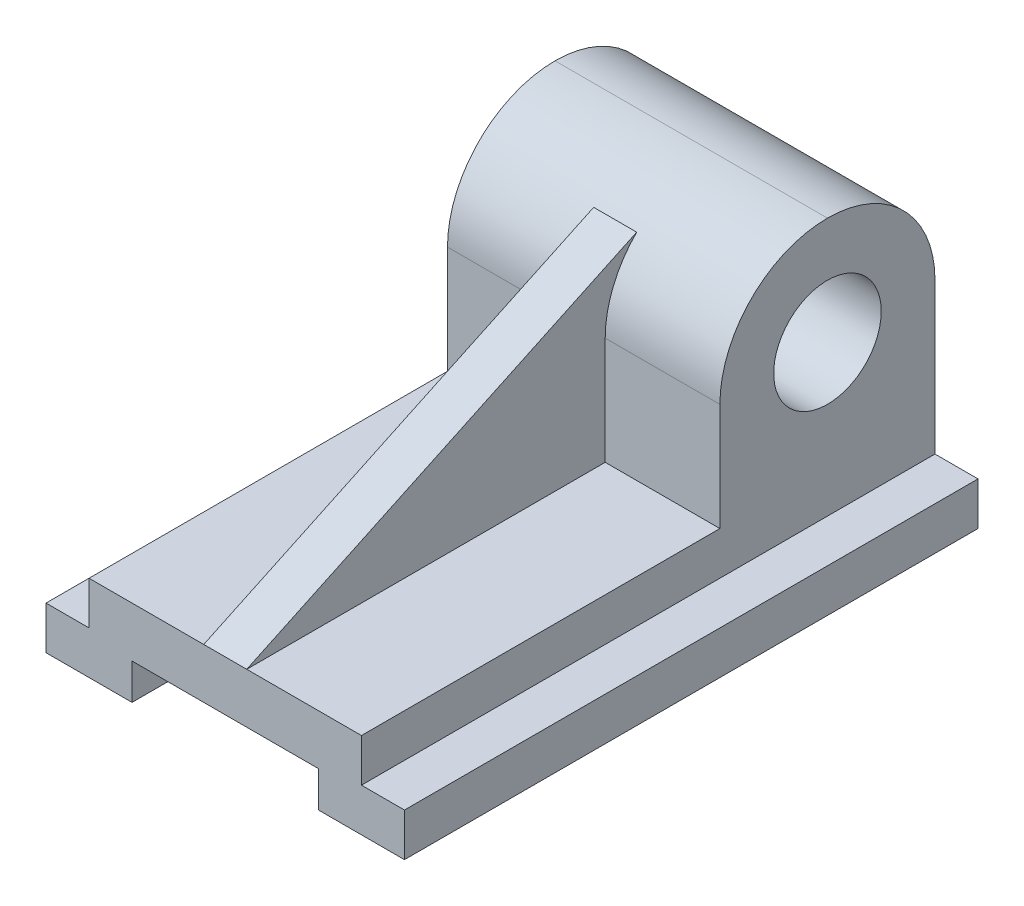
ISO-10303-21;
HEADER;
FILE_DESCRIPTION(('STEP AP214'),'2;1');
FILE_NAME('part.step','',(''),(''),'','','');
FILE_SCHEMA(('AUTOMOTIVE_DESIGN { 1 0 10303 214 1 1 1 1 }'));
ENDSEC;
DATA;
#1=APPLICATION_CONTEXT('core data for automotive mechanical design processes');
#2=APPLICATION_PROTOCOL_DEFINITION('international standard','automotive_design',2000,#1);
#3=PRODUCT_CONTEXT('',#1,'mechanical');
#4=PRODUCT('Part','Part','',(#3));
#5=PRODUCT_RELATED_PRODUCT_CATEGORY('part','',(#4));
#6=PRODUCT_DEFINITION_FORMATION('','',#4);
#7=PRODUCT_DEFINITION_CONTEXT('part definition',#1,'design');
#8=PRODUCT_DEFINITION('design','',#6,#7);
#9=PRODUCT_DEFINITION_SHAPE('','',#8);
#10=(LENGTH_UNIT() NAMED_UNIT(*) SI_UNIT(.MILLI.,.METRE.));
#11=(NAMED_UNIT(*) PLANE_ANGLE_UNIT() SI_UNIT($,.RADIAN.));
#12=(NAMED_UNIT(*) SI_UNIT($,.STERADIAN.) SOLID_ANGLE_UNIT());
#13=UNCERTAINTY_MEASURE_WITH_UNIT(LENGTH_MEASURE(1.E-05),#10,'distance_accuracy_value','');
#14=(GEOMETRIC_REPRESENTATION_CONTEXT(3) GLOBAL_UNCERTAINTY_ASSIGNED_CONTEXT((#13)) GLOBAL_UNIT_ASSIGNED_CONTEXT((#10,
#11,#12)) REPRESENTATION_CONTEXT('',''));
#15=CARTESIAN_POINT('',(0.,0.,0.));
#16=DIRECTION('',(0.,0.,1.));
#17=DIRECTION('',(1.,0.,0.));
#18=AXIS2_PLACEMENT_3D('',#15,#16,#17);
#19=CARTESIAN_POINT('',(-38.,24.,-160.));
#20=DIRECTION('',(0.,1.,0.));
#21=DIRECTION('',(0.,0.,1.));
#22=AXIS2_PLACEMENT_3D('',#19,#20,#21);
#23=PLANE('',#22);
#24=DIRECTION('',(-1.,0.,0.));
#25=VECTOR('',#24,1.);
#26=CARTESIAN_POINT('',(-38.,24.,0.));
#27=LINE('',#26,#25);
#28=CARTESIAN_POINT('',(-6.,24.,0.));
#29=VERTEX_POINT('',#28);
#30=CARTESIAN_POINT('',(-38.,24.,0.));
#31=VERTEX_POINT('',#30);
#32=EDGE_CURVE('E189',#29,#31,#27,.T.);
#33=ORIENTED_EDGE('',*,*,#32,.F.);
#34=DIRECTION('',(0.,0.,-1.));
#35=VECTOR('',#34,1.);
#36=CARTESIAN_POINT('',(-6.,24.,-160.));
#37=LINE('',#36,#35);
#38=CARTESIAN_POINT('',(-6.,24.,-100.));
#39=VERTEX_POINT('',#38);
#40=EDGE_CURVE('E169',#29,#39,#37,.T.);
#41=ORIENTED_EDGE('',*,*,#40,.T.);
#42=DIRECTION('',(1.,0.,0.));
#43=VECTOR('',#42,1.);
#44=CARTESIAN_POINT('',(-38.,24.,-100.));
#45=LINE('',#44,#43);
#46=CARTESIAN_POINT('',(-38.,24.,-100.));
#47=VERTEX_POINT('',#46);
#48=EDGE_CURVE('E216',#47,#39,#45,.T.);
#49=ORIENTED_EDGE('',*,*,#48,.F.);
#50=DIRECTION('',(0.,0.,1.));
#51=VECTOR('',#50,1.);
#52=CARTESIAN_POINT('',(-38.,24.,-160.));
#53=LINE('',#52,#51);
#54=EDGE_CURVE('E191',#47,#31,#53,.T.);
#55=ORIENTED_EDGE('',*,*,#54,.T.);
#56=EDGE_LOOP('',(#33,#41,#49,#55));
#57=FACE_BOUND('',#56,.T.);
#58=ADVANCED_FACE('F39',(#57),#23,.T.);
#59=CARTESIAN_POINT('',(-38.,84.,-100.));
#60=DIRECTION('',(0.,0.,-1.));
#61=DIRECTION('',(-1.,0.,0.));
#62=AXIS2_PLACEMENT_3D('',#59,#60,#61);
#63=PLANE('',#62);
#64=DIRECTION('',(0.,-1.,0.));
#65=VECTOR('',#64,1.);
#66=CARTESIAN_POINT('',(-6.,84.,-100.));
#67=LINE('',#66,#65);
#68=CARTESIAN_POINT('',(-6.,54.,-100.));
#69=VERTEX_POINT('',#68);
#70=EDGE_CURVE('E172',#69,#39,#67,.T.);
#71=ORIENTED_EDGE('',*,*,#70,.F.);
#72=DIRECTION('',(1.,0.,0.));
#73=VECTOR('',#72,1.);
#74=CARTESIAN_POINT('',(-38.,54.,-100.));
#75=LINE('',#74,#73);
#76=CARTESIAN_POINT('',(-38.,54.,-100.));
#77=VERTEX_POINT('',#76);
#78=EDGE_CURVE('E316',#69,#77,#75,.F.);
#79=ORIENTED_EDGE('',*,*,#78,.T.);
#80=DIRECTION('',(0.,-1.,0.));
#81=VECTOR('',#80,1.);
#82=CARTESIAN_POINT('',(-38.,84.,-100.));
#83=LINE('',#82,#81);
#84=EDGE_CURVE('E221',#77,#47,#83,.T.);
#85=ORIENTED_EDGE('',*,*,#84,.T.);
#86=ORIENTED_EDGE('',*,*,#48,.T.);
#87=EDGE_LOOP('',(#71,#79,#85,#86));
#88=FACE_BOUND('',#87,.T.);
#89=ADVANCED_FACE('F389',(#88),#63,.F.);
#90=CARTESIAN_POINT('',(-26.,0.,-160.));
#91=DIRECTION('',(1.,0.,0.));
#92=DIRECTION('',(0.,0.,-1.));
#93=AXIS2_PLACEMENT_3D('',#90,#91,#92);
#94=PLANE('',#93);
#95=DIRECTION('',(0.,1.,0.));
#96=VECTOR('',#95,1.);
#97=CARTESIAN_POINT('',(-26.,0.,0.));
#98=LINE('',#97,#96);
#99=CARTESIAN_POINT('',(-26.,0.,0.));
#100=VERTEX_POINT('',#99);
#101=CARTESIAN_POINT('',(-26.,10.,0.));
#102=VERTEX_POINT('',#101);
#103=EDGE_CURVE('E223',#100,#102,#98,.T.);
#104=ORIENTED_EDGE('',*,*,#103,.F.);
#105=DIRECTION('',(0.,0.,1.));
#106=VECTOR('',#105,1.);
#107=CARTESIAN_POINT('',(-26.,0.,-160.));
#108=LINE('',#107,#106);
#109=CARTESIAN_POINT('',(-26.,0.,-160.));
#110=VERTEX_POINT('',#109);
#111=EDGE_CURVE('E284',#110,#100,#108,.T.);
#112=ORIENTED_EDGE('',*,*,#111,.F.);
#113=DIRECTION('',(0.,1.,0.));
#114=VECTOR('',#113,1.);
#115=CARTESIAN_POINT('',(-26.,0.,-160.));
#116=LINE('',#115,#114);
#117=CARTESIAN_POINT('',(-26.,10.,-160.));
#118=VERTEX_POINT('',#117);
#119=EDGE_CURVE('E224',#110,#118,#116,.T.);
#120=ORIENTED_EDGE('',*,*,#119,.T.);
#121=DIRECTION('',(0.,0.,1.));
#122=VECTOR('',#121,1.);
#123=CARTESIAN_POINT('',(-26.,10.,-160.));
#124=LINE('',#123,#122);
#125=EDGE_CURVE('E256',#118,#102,#124,.T.);
#126=ORIENTED_EDGE('',*,*,#125,.T.);
#127=EDGE_LOOP('',(#104,#112,#120,#126));
#128=FACE_BOUND('',#127,.T.);
#129=ADVANCED_FACE('F362',(#128),#94,.T.);
#130=CARTESIAN_POINT('',(-50.,0.,-160.));
#131=DIRECTION('',(0.,-1.,0.));
#132=DIRECTION('',(1.,0.,0.));
#133=AXIS2_PLACEMENT_3D('',#130,#131,#132);
#134=PLANE('',#133);
#135=DIRECTION('',(1.,0.,0.));
#136=VECTOR('',#135,1.);
#137=CARTESIAN_POINT('',(-50.,0.,0.));
#138=LINE('',#137,#136);
#139=CARTESIAN_POINT('',(-50.,0.,0.));
#140=VERTEX_POINT('',#139);
#141=EDGE_CURVE('E228',#140,#100,#138,.T.);
#142=ORIENTED_EDGE('',*,*,#141,.F.);
#143=DIRECTION('',(0.,0.,1.));
#144=VECTOR('',#143,1.);
#145=CARTESIAN_POINT('',(-50.,0.,-160.));
#146=LINE('',#145,#144);
#147=CARTESIAN_POINT('',(-50.,0.,-160.));
#148=VERTEX_POINT('',#147);
#149=EDGE_CURVE('E287',#148,#140,#146,.T.);
#150=ORIENTED_EDGE('',*,*,#149,.F.);
#151=DIRECTION('',(1.,0.,0.));
#152=VECTOR('',#151,1.);
#153=CARTESIAN_POINT('',(-50.,0.,-160.));
#154=LINE('',#153,#152);
#155=EDGE_CURVE('E253',#148,#110,#154,.T.);
#156=ORIENTED_EDGE('',*,*,#155,.T.);
#157=ORIENTED_EDGE('',*,*,#111,.T.);
#158=EDGE_LOOP('',(#142,#150,#156,#157));
#159=FACE_BOUND('',#158,.T.);
#160=ADVANCED_FACE('F366',(#159),#134,.T.);
#161=CARTESIAN_POINT('',(-50.,12.,-160.));
#162=DIRECTION('',(-1.,0.,0.));
#163=DIRECTION('',(0.,0.,1.));
#164=AXIS2_PLACEMENT_3D('',#161,#162,#163);
#165=PLANE('',#164);
#166=DIRECTION('',(0.,-1.,0.));
#167=VECTOR('',#166,1.);
#168=CARTESIAN_POINT('',(-50.,12.,0.));
#169=LINE('',#168,#167);
#170=CARTESIAN_POINT('',(-50.,12.,0.));
#171=VERTEX_POINT('',#170);
#172=EDGE_CURVE('E279',#171,#140,#169,.T.);
#173=ORIENTED_EDGE('',*,*,#172,.F.);
#174=DIRECTION('',(0.,0.,1.));
#175=VECTOR('',#174,1.);
#176=CARTESIAN_POINT('',(-50.,12.,-160.));
#177=LINE('',#176,#175);
#178=CARTESIAN_POINT('',(-50.,12.,-160.));
#179=VERTEX_POINT('',#178);
#180=EDGE_CURVE('E289',#179,#171,#177,.T.);
#181=ORIENTED_EDGE('',*,*,#180,.F.);
#182=DIRECTION('',(0.,-1.,0.));
#183=VECTOR('',#182,1.);
#184=CARTESIAN_POINT('',(-50.,12.,-160.));
#185=LINE('',#184,#183);
#186=EDGE_CURVE('E250',#179,#148,#185,.T.);
#187=ORIENTED_EDGE('',*,*,#186,.T.);
#188=ORIENTED_EDGE('',*,*,#149,.T.);
#189=EDGE_LOOP('',(#173,#181,#187,#188));
#190=FACE_BOUND('',#189,.T.);
#191=ADVANCED_FACE('F414',(#190),#165,.T.);
#192=CARTESIAN_POINT('',(-38.,12.,-160.));
#193=DIRECTION('',(0.,1.,0.));
#194=DIRECTION('',(-1.,0.,0.));
#195=AXIS2_PLACEMENT_3D('',#192,#193,#194);
#196=PLANE('',#195);
#197=DIRECTION('',(-1.,0.,0.));
#198=VECTOR('',#197,1.);
#199=CARTESIAN_POINT('',(-38.,12.,0.));
#200=LINE('',#199,#198);
#201=CARTESIAN_POINT('',(-38.,12.,0.));
#202=VERTEX_POINT('',#201);
#203=EDGE_CURVE('E276',#202,#171,#200,.T.);
#204=ORIENTED_EDGE('',*,*,#203,.F.);
#205=DIRECTION('',(0.,0.,1.));
#206=VECTOR('',#205,1.);
#207=CARTESIAN_POINT('',(-38.,12.,-160.));
#208=LINE('',#207,#206);
#209=CARTESIAN_POINT('',(-38.,12.,-160.));
#210=VERTEX_POINT('',#209);
#211=EDGE_CURVE('E291',#210,#202,#208,.T.);
#212=ORIENTED_EDGE('',*,*,#211,.F.);
#213=DIRECTION('',(-1.,0.,0.));
#214=VECTOR('',#213,1.);
#215=CARTESIAN_POINT('',(-38.,12.,-160.));
#216=LINE('',#215,#214);
#217=EDGE_CURVE('E247',#210,#179,#216,.T.);
#218=ORIENTED_EDGE('',*,*,#217,.T.);
#219=ORIENTED_EDGE('',*,*,#180,.T.);
#220=EDGE_LOOP('',(#204,#212,#218,#219));
#221=FACE_BOUND('',#220,.T.);
#222=ADVANCED_FACE('F373',(#221),#196,.T.);
#223=CARTESIAN_POINT('',(-38.,24.,-160.));
#224=DIRECTION('',(-1.,0.,0.));
#225=DIRECTION('',(0.,0.,1.));
#226=AXIS2_PLACEMENT_3D('',#223,#224,#225);
#227=PLANE('',#226);
#228=CARTESIAN_POINT('',(-38.,54.,-130.));
#229=DIRECTION('',(-1.,0.,0.));
#230=DIRECTION('',(0.,0.,1.));
#231=AXIS2_PLACEMENT_3D('',#228,#229,#230);
#232=CIRCLE('',#231,15.);
#233=CARTESIAN_POINT('',(-38.,54.,-115.));
#234=VERTEX_POINT('',#233);
#235=EDGE_CURVE('E206',#234,#234,#232,.T.);
#236=ORIENTED_EDGE('',*,*,#235,.F.);
#237=EDGE_LOOP('',(#236));
#238=FACE_BOUND('',#237,.T.);
#239=CARTESIAN_POINT('',(-38.,54.,-130.));
#240=DIRECTION('',(-1.,0.,0.));
#241=DIRECTION('',(0.,0.,1.));
#242=AXIS2_PLACEMENT_3D('',#239,#240,#241);
#243=CIRCLE('',#242,30.);
#244=CARTESIAN_POINT('',(-38.,84.,-130.));
#245=VERTEX_POINT('',#244);
#246=EDGE_CURVE('E286',#77,#245,#243,.T.);
#247=ORIENTED_EDGE('',*,*,#246,.T.);
#248=CARTESIAN_POINT('',(-38.,54.,-130.));
#249=DIRECTION('',(-1.,0.,0.));
#250=DIRECTION('',(0.,0.,1.));
#251=AXIS2_PLACEMENT_3D('',#248,#249,#250);
#252=CIRCLE('',#251,30.);
#253=CARTESIAN_POINT('',(-38.,54.,-160.));
#254=VERTEX_POINT('',#253);
#255=EDGE_CURVE('E309',#245,#254,#252,.T.);
#256=ORIENTED_EDGE('',*,*,#255,.T.);
#257=DIRECTION('',(0.,-1.,0.));
#258=VECTOR('',#257,1.);
#259=CARTESIAN_POINT('',(-38.,24.,-160.));
#260=LINE('',#259,#258);
#261=EDGE_CURVE('E245',#254,#210,#260,.T.);
#262=ORIENTED_EDGE('',*,*,#261,.T.);
#263=ORIENTED_EDGE('',*,*,#211,.T.);
#264=DIRECTION('',(0.,-1.,0.));
#265=VECTOR('',#264,1.);
#266=CARTESIAN_POINT('',(-38.,24.,0.));
#267=LINE('',#266,#265);
#268=EDGE_CURVE('E274',#31,#202,#267,.T.);
#269=ORIENTED_EDGE('',*,*,#268,.F.);
#270=ORIENTED_EDGE('',*,*,#54,.F.);
#271=ORIENTED_EDGE('',*,*,#84,.F.);
#272=EDGE_LOOP('',(#247,#256,#262,#263,#269,#270,#271));
#273=FACE_BOUND('',#272,.T.);
#274=ADVANCED_FACE('F376',(#238,#273),#227,.T.);
#275=DIRECTION('',(0.,0.,-1.));
#276=VECTOR('',#275,1.);
#277=CARTESIAN_POINT('',(6.,24.,-160.));
#278=LINE('',#277,#276);
#279=CARTESIAN_POINT('',(6.,24.,0.));
#280=VERTEX_POINT('',#279);
#281=CARTESIAN_POINT('',(6.,24.,-100.));
#282=VERTEX_POINT('',#281);
#283=EDGE_CURVE('E333',#280,#282,#278,.T.);
#284=ORIENTED_EDGE('',*,*,#283,.F.);
#285=CARTESIAN_POINT('',(38.,24.,0.));
#286=VERTEX_POINT('',#285);
#287=EDGE_CURVE('E195',#286,#280,#27,.T.);
#288=ORIENTED_EDGE('',*,*,#287,.F.);
#289=DIRECTION('',(0.,0.,1.));
#290=VECTOR('',#289,1.);
#291=CARTESIAN_POINT('',(38.,24.,-160.));
#292=LINE('',#291,#290);
#293=CARTESIAN_POINT('',(38.,24.,-100.));
#294=VERTEX_POINT('',#293);
#295=EDGE_CURVE('E294',#294,#286,#292,.T.);
#296=ORIENTED_EDGE('',*,*,#295,.F.);
#297=EDGE_CURVE('E219',#282,#294,#45,.T.);
#298=ORIENTED_EDGE('',*,*,#297,.F.);
#299=EDGE_LOOP('',(#284,#288,#296,#298));
#300=FACE_BOUND('',#299,.T.);
#301=ADVANCED_FACE('F332',(#300),#23,.T.);
#302=CARTESIAN_POINT('',(38.,24.,-160.));
#303=DIRECTION('',(1.,0.,0.));
#304=DIRECTION('',(0.,0.,-1.));
#305=AXIS2_PLACEMENT_3D('',#302,#303,#304);
#306=PLANE('',#305);
#307=CARTESIAN_POINT('',(38.,54.,-130.));
#308=DIRECTION('',(1.,0.,0.));
#309=DIRECTION('',(0.,0.,-1.));
#310=AXIS2_PLACEMENT_3D('',#307,#308,#309);
#311=CIRCLE('',#310,15.);
#312=CARTESIAN_POINT('',(38.,54.,-145.));
#313=VERTEX_POINT('',#312);
#314=EDGE_CURVE('E202',#313,#313,#311,.T.);
#315=ORIENTED_EDGE('',*,*,#314,.F.);
#316=EDGE_LOOP('',(#315));
#317=FACE_BOUND('',#316,.T.);
#318=DIRECTION('',(0.,1.,0.));
#319=VECTOR('',#318,1.);
#320=CARTESIAN_POINT('',(38.,24.,-160.));
#321=LINE('',#320,#319);
#322=CARTESIAN_POINT('',(38.,12.,-160.));
#323=VERTEX_POINT('',#322);
#324=CARTESIAN_POINT('',(38.,54.,-160.));
#325=VERTEX_POINT('',#324);
#326=EDGE_CURVE('E242',#323,#325,#321,.T.);
#327=ORIENTED_EDGE('',*,*,#326,.T.);
#328=CARTESIAN_POINT('',(38.,54.,-130.));
#329=DIRECTION('',(1.,0.,0.));
#330=DIRECTION('',(0.,0.,-1.));
#331=AXIS2_PLACEMENT_3D('',#328,#329,#330);
#332=CIRCLE('',#331,30.);
#333=CARTESIAN_POINT('',(38.,84.,-130.));
#334=VERTEX_POINT('',#333);
#335=EDGE_CURVE('E314',#325,#334,#332,.T.);
#336=ORIENTED_EDGE('',*,*,#335,.T.);
#337=CARTESIAN_POINT('',(38.,54.,-130.));
#338=DIRECTION('',(1.,0.,0.));
#339=DIRECTION('',(0.,0.,-1.));
#340=AXIS2_PLACEMENT_3D('',#337,#338,#339);
#341=CIRCLE('',#340,30.);
#342=CARTESIAN_POINT('',(38.,54.,-100.));
#343=VERTEX_POINT('',#342);
#344=EDGE_CURVE('E61',#334,#343,#341,.T.);
#345=ORIENTED_EDGE('',*,*,#344,.T.);
#346=DIRECTION('',(0.,-1.,0.));
#347=VECTOR('',#346,1.);
#348=CARTESIAN_POINT('',(38.,84.,-100.));
#349=LINE('',#348,#347);
#350=EDGE_CURVE('E218',#343,#294,#349,.T.);
#351=ORIENTED_EDGE('',*,*,#350,.T.);
#352=ORIENTED_EDGE('',*,*,#295,.T.);
#353=DIRECTION('',(0.,1.,0.));
#354=VECTOR('',#353,1.);
#355=CARTESIAN_POINT('',(38.,24.,0.));
#356=LINE('',#355,#354);
#357=CARTESIAN_POINT('',(38.,12.,0.));
#358=VERTEX_POINT('',#357);
#359=EDGE_CURVE('E196',#358,#286,#356,.T.);
#360=ORIENTED_EDGE('',*,*,#359,.F.);
#361=DIRECTION('',(0.,0.,1.));
#362=VECTOR('',#361,1.);
#363=CARTESIAN_POINT('',(38.,12.,-160.));
#364=LINE('',#363,#362);
#365=EDGE_CURVE('E296',#323,#358,#364,.T.);
#366=ORIENTED_EDGE('',*,*,#365,.F.);
#367=EDGE_LOOP('',(#327,#336,#345,#351,#352,#360,#366));
#368=FACE_BOUND('',#367,.T.);
#369=ADVANCED_FACE('F330',(#317,#368),#306,.T.);
#370=CARTESIAN_POINT('',(38.,12.,-160.));
#371=DIRECTION('',(0.,1.,0.));
#372=DIRECTION('',(-1.,0.,0.));
#373=AXIS2_PLACEMENT_3D('',#370,#371,#372);
#374=PLANE('',#373);
#375=DIRECTION('',(-1.,0.,0.));
#376=VECTOR('',#375,1.);
#377=CARTESIAN_POINT('',(38.,12.,0.));
#378=LINE('',#377,#376);
#379=CARTESIAN_POINT('',(50.,12.,0.));
#380=VERTEX_POINT('',#379);
#381=EDGE_CURVE('E270',#380,#358,#378,.T.);
#382=ORIENTED_EDGE('',*,*,#381,.F.);
#383=DIRECTION('',(0.,0.,1.));
#384=VECTOR('',#383,1.);
#385=CARTESIAN_POINT('',(50.,12.,-160.));
#386=LINE('',#385,#384);
#387=CARTESIAN_POINT('',(50.,12.,-160.));
#388=VERTEX_POINT('',#387);
#389=EDGE_CURVE('E298',#388,#380,#386,.T.);
#390=ORIENTED_EDGE('',*,*,#389,.F.);
#391=DIRECTION('',(-1.,0.,0.));
#392=VECTOR('',#391,1.);
#393=CARTESIAN_POINT('',(38.,12.,-160.));
#394=LINE('',#393,#392);
#395=EDGE_CURVE('E239',#388,#323,#394,.T.);
#396=ORIENTED_EDGE('',*,*,#395,.T.);
#397=ORIENTED_EDGE('',*,*,#365,.T.);
#398=EDGE_LOOP('',(#382,#390,#396,#397));
#399=FACE_BOUND('',#398,.T.);
#400=ADVANCED_FACE('F344',(#399),#374,.T.);
#401=CARTESIAN_POINT('',(50.,12.,-160.));
#402=DIRECTION('',(1.,0.,0.));
#403=DIRECTION('',(0.,0.,-1.));
#404=AXIS2_PLACEMENT_3D('',#401,#402,#403);
#405=PLANE('',#404);
#406=DIRECTION('',(0.,1.,0.));
#407=VECTOR('',#406,1.);
#408=CARTESIAN_POINT('',(50.,12.,0.));
#409=LINE('',#408,#407);
#410=CARTESIAN_POINT('',(50.,0.,0.));
#411=VERTEX_POINT('',#410);
#412=EDGE_CURVE('E267',#411,#380,#409,.T.);
#413=ORIENTED_EDGE('',*,*,#412,.F.);
#414=DIRECTION('',(0.,0.,1.));
#415=VECTOR('',#414,1.);
#416=CARTESIAN_POINT('',(50.,0.,-160.));
#417=LINE('',#416,#415);
#418=CARTESIAN_POINT('',(50.,0.,-160.));
#419=VERTEX_POINT('',#418);
#420=EDGE_CURVE('E300',#419,#411,#417,.T.);
#421=ORIENTED_EDGE('',*,*,#420,.F.);
#422=DIRECTION('',(0.,1.,0.));
#423=VECTOR('',#422,1.);
#424=CARTESIAN_POINT('',(50.,12.,-160.));
#425=LINE('',#424,#423);
#426=EDGE_CURVE('E236',#419,#388,#425,.T.);
#427=ORIENTED_EDGE('',*,*,#426,.T.);
#428=ORIENTED_EDGE('',*,*,#389,.T.);
#429=EDGE_LOOP('',(#413,#421,#427,#428));
#430=FACE_BOUND('',#429,.T.);
#431=ADVANCED_FACE('F347',(#430),#405,.T.);
#432=CARTESIAN_POINT('',(50.,0.,-160.));
#433=DIRECTION('',(0.,-1.,0.));
#434=DIRECTION('',(1.,0.,0.));
#435=AXIS2_PLACEMENT_3D('',#432,#433,#434);
#436=PLANE('',#435);
#437=DIRECTION('',(1.,0.,0.));
#438=VECTOR('',#437,1.);
#439=CARTESIAN_POINT('',(50.,0.,0.));
#440=LINE('',#439,#438);
#441=CARTESIAN_POINT('',(26.,0.,0.));
#442=VERTEX_POINT('',#441);
#443=EDGE_CURVE('E264',#442,#411,#440,.T.);
#444=ORIENTED_EDGE('',*,*,#443,.F.);
#445=DIRECTION('',(0.,0.,1.));
#446=VECTOR('',#445,1.);
#447=CARTESIAN_POINT('',(26.,0.,-160.));
#448=LINE('',#447,#446);
#449=CARTESIAN_POINT('',(26.,0.,-160.));
#450=VERTEX_POINT('',#449);
#451=EDGE_CURVE('E302',#450,#442,#448,.T.);
#452=ORIENTED_EDGE('',*,*,#451,.F.);
#453=DIRECTION('',(1.,0.,0.));
#454=VECTOR('',#453,1.);
#455=CARTESIAN_POINT('',(50.,0.,-160.));
#456=LINE('',#455,#454);
#457=EDGE_CURVE('E233',#450,#419,#456,.T.);
#458=ORIENTED_EDGE('',*,*,#457,.T.);
#459=ORIENTED_EDGE('',*,*,#420,.T.);
#460=EDGE_LOOP('',(#444,#452,#458,#459));
#461=FACE_BOUND('',#460,.T.);
#462=ADVANCED_FACE('F351',(#461),#436,.T.);
#463=CARTESIAN_POINT('',(26.,0.,-160.));
#464=DIRECTION('',(-1.,0.,0.));
#465=DIRECTION('',(0.,0.,1.));
#466=AXIS2_PLACEMENT_3D('',#463,#464,#465);
#467=PLANE('',#466);
#468=DIRECTION('',(0.,-1.,0.));
#469=VECTOR('',#468,1.);
#470=CARTESIAN_POINT('',(26.,0.,0.));
#471=LINE('',#470,#469);
#472=CARTESIAN_POINT('',(26.,10.,0.));
#473=VERTEX_POINT('',#472);
#474=EDGE_CURVE('E261',#473,#442,#471,.T.);
#475=ORIENTED_EDGE('',*,*,#474,.F.);
#476=DIRECTION('',(0.,0.,1.));
#477=VECTOR('',#476,1.);
#478=CARTESIAN_POINT('',(26.,10.,-160.));
#479=LINE('',#478,#477);
#480=CARTESIAN_POINT('',(26.,10.,-160.));
#481=VERTEX_POINT('',#480);
#482=EDGE_CURVE('E304',#481,#473,#479,.T.);
#483=ORIENTED_EDGE('',*,*,#482,.F.);
#484=DIRECTION('',(0.,-1.,0.));
#485=VECTOR('',#484,1.);
#486=CARTESIAN_POINT('',(26.,0.,-160.));
#487=LINE('',#486,#485);
#488=EDGE_CURVE('E230',#481,#450,#487,.T.);
#489=ORIENTED_EDGE('',*,*,#488,.T.);
#490=ORIENTED_EDGE('',*,*,#451,.T.);
#491=EDGE_LOOP('',(#475,#483,#489,#490));
#492=FACE_BOUND('',#491,.T.);
#493=ADVANCED_FACE('F354',(#492),#467,.T.);
#494=CARTESIAN_POINT('',(26.,10.,-160.));
#495=DIRECTION('',(0.,-1.,0.));
#496=DIRECTION('',(0.,0.,-1.));
#497=AXIS2_PLACEMENT_3D('',#494,#495,#496);
#498=PLANE('',#497);
#499=ORIENTED_EDGE('',*,*,#482,.T.);
#500=DIRECTION('',(1.,0.,0.));
#501=VECTOR('',#500,1.);
#502=CARTESIAN_POINT('',(26.,10.,0.));
#503=LINE('',#502,#501);
#504=EDGE_CURVE('E259',#102,#473,#503,.T.);
#505=ORIENTED_EDGE('',*,*,#504,.F.);
#506=ORIENTED_EDGE('',*,*,#125,.F.);
#507=DIRECTION('',(1.,0.,0.));
#508=VECTOR('',#507,1.);
#509=CARTESIAN_POINT('',(26.,10.,-160.));
#510=LINE('',#509,#508);
#511=EDGE_CURVE('E227',#118,#481,#510,.T.);
#512=ORIENTED_EDGE('',*,*,#511,.T.);
#513=EDGE_LOOP('',(#499,#505,#506,#512));
#514=FACE_BOUND('',#513,.T.);
#515=ADVANCED_FACE('F410',(#514),#498,.T.);
#516=CARTESIAN_POINT('',(0.,0.,-160.));
#517=DIRECTION('',(0.,0.,1.));
#518=DIRECTION('',(1.,0.,0.));
#519=AXIS2_PLACEMENT_3D('',#516,#517,#518);
#520=PLANE('',#519);
#521=ORIENTED_EDGE('',*,*,#488,.F.);
#522=ORIENTED_EDGE('',*,*,#511,.F.);
#523=ORIENTED_EDGE('',*,*,#119,.F.);
#524=ORIENTED_EDGE('',*,*,#155,.F.);
#525=ORIENTED_EDGE('',*,*,#186,.F.);
#526=ORIENTED_EDGE('',*,*,#217,.F.);
#527=ORIENTED_EDGE('',*,*,#261,.F.);
#528=DIRECTION('',(-1.,0.,0.));
#529=VECTOR('',#528,1.);
#530=CARTESIAN_POINT('',(38.,54.,-160.));
#531=LINE('',#530,#529);
#532=EDGE_CURVE('E311',#254,#325,#531,.F.);
#533=ORIENTED_EDGE('',*,*,#532,.T.);
#534=ORIENTED_EDGE('',*,*,#326,.F.);
#535=ORIENTED_EDGE('',*,*,#395,.F.);
#536=ORIENTED_EDGE('',*,*,#426,.F.);
#537=ORIENTED_EDGE('',*,*,#457,.F.);
#538=EDGE_LOOP('',(#521,#522,#523,#524,#525,#526,#527,#533,#534,#535,#536,#537));
#539=FACE_BOUND('',#538,.T.);
#540=ADVANCED_FACE('F340',(#539),#520,.F.);
#541=CARTESIAN_POINT('',(0.,0.,0.));
#542=DIRECTION('',(0.,0.,1.));
#543=DIRECTION('',(1.,0.,0.));
#544=AXIS2_PLACEMENT_3D('',#541,#542,#543);
#545=PLANE('',#544);
#546=ORIENTED_EDGE('',*,*,#287,.T.);
#547=DIRECTION('',(1.,0.,0.));
#548=VECTOR('',#547,1.);
#549=CARTESIAN_POINT('',(0.,24.,0.));
#550=LINE('',#549,#548);
#551=EDGE_CURVE('E183',#280,#29,#550,.F.);
#552=ORIENTED_EDGE('',*,*,#551,.T.);
#553=ORIENTED_EDGE('',*,*,#32,.T.);
#554=ORIENTED_EDGE('',*,*,#268,.T.);
#555=ORIENTED_EDGE('',*,*,#203,.T.);
#556=ORIENTED_EDGE('',*,*,#172,.T.);
#557=ORIENTED_EDGE('',*,*,#141,.T.);
#558=ORIENTED_EDGE('',*,*,#103,.T.);
#559=ORIENTED_EDGE('',*,*,#504,.T.);
#560=ORIENTED_EDGE('',*,*,#474,.T.);
#561=ORIENTED_EDGE('',*,*,#443,.T.);
#562=ORIENTED_EDGE('',*,*,#412,.T.);
#563=ORIENTED_EDGE('',*,*,#381,.T.);
#564=ORIENTED_EDGE('',*,*,#359,.T.);
#565=EDGE_LOOP('',(#546,#552,#553,#554,#555,#556,#557,#558,#559,#560,#561,#562,#563,#564));
#566=FACE_BOUND('',#565,.T.);
#567=ADVANCED_FACE('F199',(#566),#545,.T.);
#568=CARTESIAN_POINT('',(6.,54.,-100.));
#569=VERTEX_POINT('',#568);
#570=EDGE_CURVE('E47',#343,#569,#75,.F.);
#571=ORIENTED_EDGE('',*,*,#570,.T.);
#572=DIRECTION('',(0.,-1.,0.));
#573=VECTOR('',#572,1.);
#574=CARTESIAN_POINT('',(6.,84.,-100.));
#575=LINE('',#574,#573);
#576=EDGE_CURVE('E208',#569,#282,#575,.T.);
#577=ORIENTED_EDGE('',*,*,#576,.T.);
#578=ORIENTED_EDGE('',*,*,#297,.T.);
#579=ORIENTED_EDGE('',*,*,#350,.F.);
#580=EDGE_LOOP('',(#571,#577,#578,#579));
#581=FACE_BOUND('',#580,.T.);
#582=ADVANCED_FACE('F325',(#581),#63,.F.);
#583=CARTESIAN_POINT('',(0.,54.,-130.));
#584=DIRECTION('',(-1.,0.,0.));
#585=DIRECTION('',(0.,0.,1.));
#586=AXIS2_PLACEMENT_3D('',#583,#584,#585);
#587=CYLINDRICAL_SURFACE('',#586,30.);
#588=ORIENTED_EDGE('',*,*,#344,.F.);
#589=DIRECTION('',(1.,0.,0.));
#590=VECTOR('',#589,1.);
#591=CARTESIAN_POINT('',(38.,84.,-130.));
#592=LINE('',#591,#590);
#593=EDGE_CURVE('E215',#245,#334,#592,.T.);
#594=ORIENTED_EDGE('',*,*,#593,.F.);
#595=ORIENTED_EDGE('',*,*,#246,.F.);
#596=ORIENTED_EDGE('',*,*,#78,.F.);
#597=CARTESIAN_POINT('',(-6.,54.,-130.));
#598=DIRECTION('',(1.,0.,0.));
#599=DIRECTION('',(0.,0.,-1.));
#600=AXIS2_PLACEMENT_3D('',#597,#598,#599);
#601=CIRCLE('',#600,30.);
#602=CARTESIAN_POINT('',(-6.,75.2132034355964,-108.786796564404));
#603=VERTEX_POINT('',#602);
#604=EDGE_CURVE('E385',#69,#603,#601,.F.);
#605=ORIENTED_EDGE('',*,*,#604,.T.);
#606=DIRECTION('',(-1.,0.,0.));
#607=VECTOR('',#606,1.);
#608=CARTESIAN_POINT('',(0.,75.2132034355964,-108.786796564404));
#609=LINE('',#608,#607);
#610=CARTESIAN_POINT('',(6.,75.2132034355964,-108.786796564404));
#611=VERTEX_POINT('',#610);
#612=EDGE_CURVE('E11',#611,#603,#609,.T.);
#613=ORIENTED_EDGE('',*,*,#612,.F.);
#614=CARTESIAN_POINT('',(6.,54.,-130.));
#615=DIRECTION('',(1.,0.,0.));
#616=DIRECTION('',(0.,0.,-1.));
#617=AXIS2_PLACEMENT_3D('',#614,#615,#616);
#618=CIRCLE('',#617,30.);
#619=EDGE_CURVE('E203',#569,#611,#618,.F.);
#620=ORIENTED_EDGE('',*,*,#619,.F.);
#621=ORIENTED_EDGE('',*,*,#570,.F.);
#622=EDGE_LOOP('',(#588,#594,#595,#596,#605,#613,#620,#621));
#623=FACE_BOUND('',#622,.T.);
#624=ADVANCED_FACE('F41',(#623),#587,.T.);
#625=CARTESIAN_POINT('',(0.,54.,-130.));
#626=DIRECTION('',(1.,0.,0.));
#627=DIRECTION('',(0.,0.,-1.));
#628=AXIS2_PLACEMENT_3D('',#625,#626,#627);
#629=CYLINDRICAL_SURFACE('',#628,30.);
#630=ORIENTED_EDGE('',*,*,#335,.F.);
#631=ORIENTED_EDGE('',*,*,#532,.F.);
#632=ORIENTED_EDGE('',*,*,#255,.F.);
#633=ORIENTED_EDGE('',*,*,#593,.T.);
#634=EDGE_LOOP('',(#630,#631,#632,#633));
#635=FACE_BOUND('',#634,.T.);
#636=ADVANCED_FACE('F377',(#635),#629,.T.);
#637=CARTESIAN_POINT('',(-50.,54.,-130.));
#638=DIRECTION('',(1.,0.,0.));
#639=DIRECTION('',(0.,0.,-1.));
#640=AXIS2_PLACEMENT_3D('',#637,#638,#639);
#641=CYLINDRICAL_SURFACE('',#640,15.);
#642=ORIENTED_EDGE('',*,*,#314,.T.);
#643=EDGE_LOOP('',(#642));
#644=FACE_BOUND('',#643,.T.);
#645=ORIENTED_EDGE('',*,*,#235,.T.);
#646=EDGE_LOOP('',(#645));
#647=FACE_BOUND('',#646,.T.);
#648=ADVANCED_FACE('F436',(#644,#647),#641,.F.);
#649=CARTESIAN_POINT('',(0.,24.,0.));
#650=DIRECTION('',(0.,-0.904756477162768,-0.425929239465922));
#651=DIRECTION('',(0.,0.425929239465922,-0.904756477162768));
#652=AXIS2_PLACEMENT_3D('',#649,#650,#651);
#653=PLANE('',#652);
#654=ORIENTED_EDGE('',*,*,#551,.F.);
#655=DIRECTION('',(0.,0.425929239465922,-0.904756477162768));
#656=VECTOR('',#655,1.);
#657=CARTESIAN_POINT('',(6.,24.,0.));
#658=LINE('',#657,#656);
#659=EDGE_CURVE('E177',#280,#611,#658,.T.);
#660=ORIENTED_EDGE('',*,*,#659,.T.);
#661=ORIENTED_EDGE('',*,*,#612,.T.);
#662=DIRECTION('',(0.,0.425929239465922,-0.904756477162768));
#663=VECTOR('',#662,1.);
#664=CARTESIAN_POINT('',(-6.,24.,0.));
#665=LINE('',#664,#663);
#666=EDGE_CURVE('E54',#29,#603,#665,.T.);
#667=ORIENTED_EDGE('',*,*,#666,.F.);
#668=EDGE_LOOP('',(#654,#660,#661,#667));
#669=FACE_BOUND('',#668,.T.);
#670=ADVANCED_FACE('F180',(#669),#653,.F.);
#671=CARTESIAN_POINT('',(6.,42.,-80.));
#672=DIRECTION('',(1.,0.,0.));
#673=DIRECTION('',(0.,0.,-1.));
#674=AXIS2_PLACEMENT_3D('',#671,#672,#673);
#675=PLANE('',#674);
#676=ORIENTED_EDGE('',*,*,#576,.F.);
#677=ORIENTED_EDGE('',*,*,#619,.T.);
#678=ORIENTED_EDGE('',*,*,#659,.F.);
#679=ORIENTED_EDGE('',*,*,#283,.T.);
#680=EDGE_LOOP('',(#676,#677,#678,#679));
#681=FACE_BOUND('',#680,.T.);
#682=ADVANCED_FACE('F382',(#681),#675,.T.);
#683=CARTESIAN_POINT('',(-6.,42.,-80.));
#684=DIRECTION('',(1.,0.,0.));
#685=DIRECTION('',(0.,0.,-1.));
#686=AXIS2_PLACEMENT_3D('',#683,#684,#685);
#687=PLANE('',#686);
#688=ORIENTED_EDGE('',*,*,#604,.F.);
#689=ORIENTED_EDGE('',*,*,#70,.T.);
#690=ORIENTED_EDGE('',*,*,#40,.F.);
#691=ORIENTED_EDGE('',*,*,#666,.T.);
#692=EDGE_LOOP('',(#688,#689,#690,#691));
#693=FACE_BOUND('',#692,.T.);
#694=ADVANCED_FACE('F170',(#693),#687,.F.);
#695=CLOSED_SHELL('',(#58,#89,#129,#160,#191,#222,#274,#301,#369,#400,#431,#462,#493,#515,#540,
#567,#582,#624,#636,#648,#670,#682,#694));
#696=MANIFOLD_SOLID_BREP('B2',#695);
#697=ADVANCED_BREP_SHAPE_REPRESENTATION('',(#18,#696),#14);
#698=SHAPE_DEFINITION_REPRESENTATION(#9,#697);
ENDSEC;
END-ISO-10303-21;
